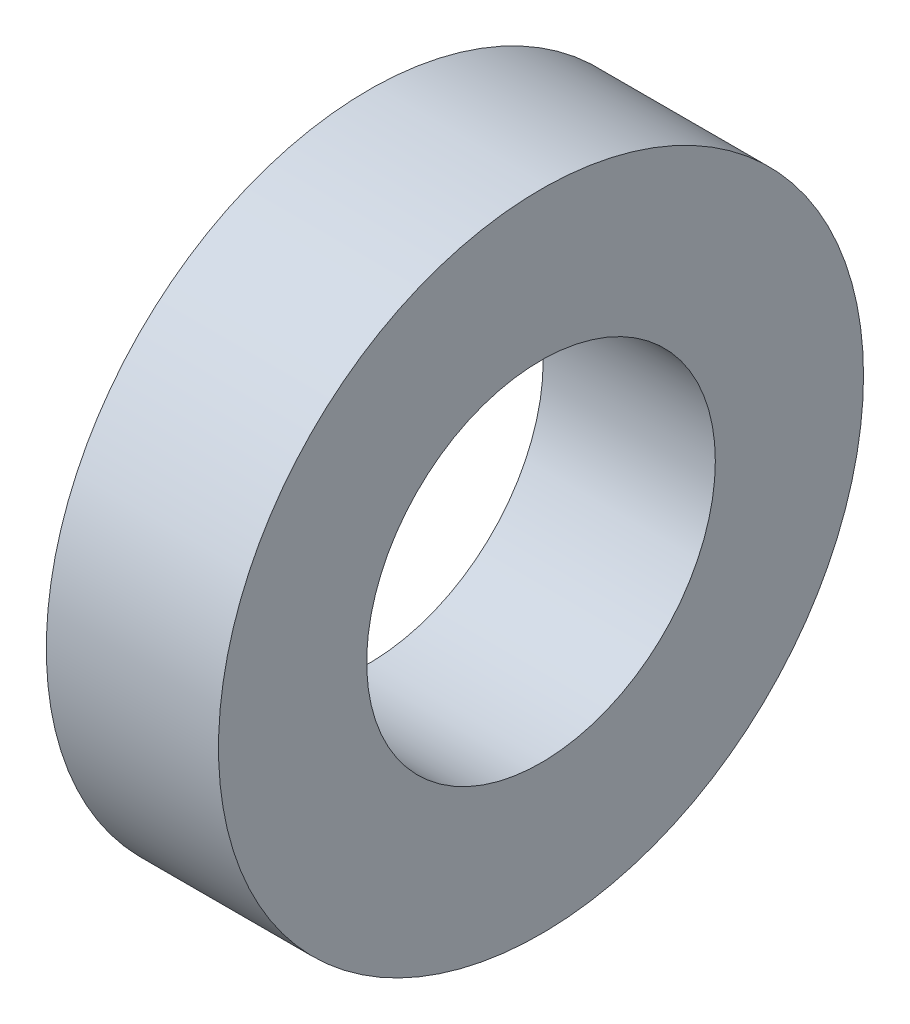
ISO-10303-21;
HEADER;
FILE_DESCRIPTION(('STEP AP214'),'2;1');
FILE_NAME('part.step','',(''),(''),'','','');
FILE_SCHEMA(('AUTOMOTIVE_DESIGN { 1 0 10303 214 1 1 1 1 }'));
ENDSEC;
DATA;
#1=APPLICATION_CONTEXT('core data for automotive mechanical design processes');
#2=APPLICATION_PROTOCOL_DEFINITION('international standard','automotive_design',2000,#1);
#3=PRODUCT_CONTEXT('',#1,'mechanical');
#4=PRODUCT('Part','Part','',(#3));
#5=PRODUCT_RELATED_PRODUCT_CATEGORY('part','',(#4));
#6=PRODUCT_DEFINITION_FORMATION('','',#4);
#7=PRODUCT_DEFINITION_CONTEXT('part definition',#1,'design');
#8=PRODUCT_DEFINITION('design','',#6,#7);
#9=PRODUCT_DEFINITION_SHAPE('','',#8);
#10=(LENGTH_UNIT() NAMED_UNIT(*) SI_UNIT(.MILLI.,.METRE.));
#11=(NAMED_UNIT(*) PLANE_ANGLE_UNIT() SI_UNIT($,.RADIAN.));
#12=(NAMED_UNIT(*) SI_UNIT($,.STERADIAN.) SOLID_ANGLE_UNIT());
#13=UNCERTAINTY_MEASURE_WITH_UNIT(LENGTH_MEASURE(1.E-05),#10,'distance_accuracy_value','');
#14=(GEOMETRIC_REPRESENTATION_CONTEXT(3) GLOBAL_UNCERTAINTY_ASSIGNED_CONTEXT((#13)) GLOBAL_UNIT_ASSIGNED_CONTEXT((#10,
#11,#12)) REPRESENTATION_CONTEXT('',''));
#15=CARTESIAN_POINT('',(0.,0.,0.));
#16=DIRECTION('',(0.,0.,1.));
#17=DIRECTION('',(1.,0.,0.));
#18=AXIS2_PLACEMENT_3D('',#15,#16,#17);
#19=CARTESIAN_POINT('',(7.84,0.,0.));
#20=DIRECTION('',(1.,0.,0.));
#21=DIRECTION('',(0.,0.,-1.));
#22=AXIS2_PLACEMENT_3D('',#19,#20,#21);
#23=PLANE('',#22);
#24=CARTESIAN_POINT('',(7.84,0.,0.));
#25=DIRECTION('',(1.,0.,0.));
#26=DIRECTION('',(0.,0.,-1.));
#27=AXIS2_PLACEMENT_3D('',#24,#25,#26);
#28=CIRCLE('',#27,29.36875);
#29=CARTESIAN_POINT('',(7.84,0.,-29.36875));
#30=VERTEX_POINT('',#29);
#31=EDGE_CURVE('E10',#30,#30,#28,.T.);
#32=ORIENTED_EDGE('',*,*,#31,.T.);
#33=EDGE_LOOP('',(#32));
#34=FACE_BOUND('',#33,.T.);
#35=CARTESIAN_POINT('',(7.84,0.,0.));
#36=DIRECTION('',(1.,0.,0.));
#37=DIRECTION('',(0.,0.,-1.));
#38=AXIS2_PLACEMENT_3D('',#35,#36,#37);
#39=CIRCLE('',#38,15.875);
#40=CARTESIAN_POINT('',(7.84,0.,-15.875));
#41=VERTEX_POINT('',#40);
#42=EDGE_CURVE('E45',#41,#41,#39,.T.);
#43=ORIENTED_EDGE('',*,*,#42,.F.);
#44=EDGE_LOOP('',(#43));
#45=FACE_BOUND('',#44,.T.);
#46=ADVANCED_FACE('F34',(#34,#45),#23,.T.);
#47=CARTESIAN_POINT('',(-7.84,0.,0.));
#48=DIRECTION('',(1.,0.,0.));
#49=DIRECTION('',(0.,0.,-1.));
#50=AXIS2_PLACEMENT_3D('',#47,#48,#49);
#51=PLANE('',#50);
#52=CARTESIAN_POINT('',(-7.84,0.,0.));
#53=DIRECTION('',(1.,0.,0.));
#54=DIRECTION('',(0.,0.,-1.));
#55=AXIS2_PLACEMENT_3D('',#52,#53,#54);
#56=CIRCLE('',#55,29.36875);
#57=CARTESIAN_POINT('',(-7.84,0.,-29.36875));
#58=VERTEX_POINT('',#57);
#59=EDGE_CURVE('E38',#58,#58,#56,.T.);
#60=ORIENTED_EDGE('',*,*,#59,.F.);
#61=EDGE_LOOP('',(#60));
#62=FACE_BOUND('',#61,.T.);
#63=CARTESIAN_POINT('',(-7.84,0.,0.));
#64=DIRECTION('',(1.,0.,0.));
#65=DIRECTION('',(0.,0.,-1.));
#66=AXIS2_PLACEMENT_3D('',#63,#64,#65);
#67=CIRCLE('',#66,15.875);
#68=CARTESIAN_POINT('',(-7.84,0.,-15.875));
#69=VERTEX_POINT('',#68);
#70=EDGE_CURVE('E47',#69,#69,#67,.T.);
#71=ORIENTED_EDGE('',*,*,#70,.T.);
#72=EDGE_LOOP('',(#71));
#73=FACE_BOUND('',#72,.T.);
#74=ADVANCED_FACE('F57',(#62,#73),#51,.F.);
#75=CARTESIAN_POINT('',(7.84,0.,0.));
#76=DIRECTION('',(-1.,0.,0.));
#77=DIRECTION('',(0.,0.,1.));
#78=AXIS2_PLACEMENT_3D('',#75,#76,#77);
#79=CYLINDRICAL_SURFACE('',#78,29.36875);
#80=ORIENTED_EDGE('',*,*,#31,.F.);
#81=EDGE_LOOP('',(#80));
#82=FACE_BOUND('',#81,.T.);
#83=ORIENTED_EDGE('',*,*,#59,.T.);
#84=EDGE_LOOP('',(#83));
#85=FACE_BOUND('',#84,.T.);
#86=ADVANCED_FACE('F36',(#82,#85),#79,.T.);
#87=CARTESIAN_POINT('',(7.84,0.,0.));
#88=DIRECTION('',(-1.,0.,0.));
#89=DIRECTION('',(0.,0.,1.));
#90=AXIS2_PLACEMENT_3D('',#87,#88,#89);
#91=CYLINDRICAL_SURFACE('',#90,15.875);
#92=ORIENTED_EDGE('',*,*,#42,.T.);
#93=EDGE_LOOP('',(#92));
#94=FACE_BOUND('',#93,.T.);
#95=ORIENTED_EDGE('',*,*,#70,.F.);
#96=EDGE_LOOP('',(#95));
#97=FACE_BOUND('',#96,.T.);
#98=ADVANCED_FACE('F53',(#94,#97),#91,.F.);
#99=CLOSED_SHELL('',(#46,#74,#86,#98));
#100=MANIFOLD_SOLID_BREP('B2',#99);
#101=ADVANCED_BREP_SHAPE_REPRESENTATION('',(#18,#100),#14);
#102=SHAPE_DEFINITION_REPRESENTATION(#9,#101);
ENDSEC;
END-ISO-10303-21;
